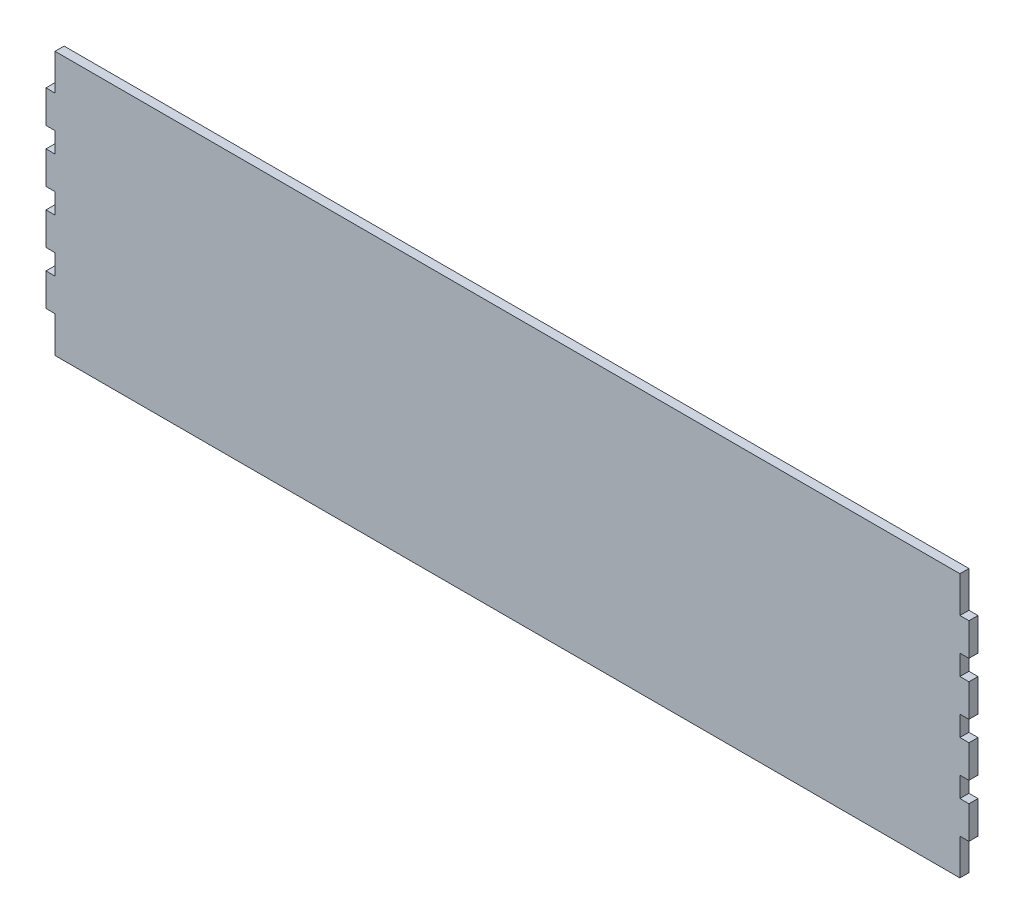
ISO-10303-21;
HEADER;
FILE_DESCRIPTION(('STEP AP214'),'2;1');
FILE_NAME('part.step','',(''),(''),'','','');
FILE_SCHEMA(('AUTOMOTIVE_DESIGN { 1 0 10303 214 1 1 1 1 }'));
ENDSEC;
DATA;
#1=APPLICATION_CONTEXT('core data for automotive mechanical design processes');
#2=APPLICATION_PROTOCOL_DEFINITION('international standard','automotive_design',2000,#1);
#3=PRODUCT_CONTEXT('',#1,'mechanical');
#4=PRODUCT('Part','Part','',(#3));
#5=PRODUCT_RELATED_PRODUCT_CATEGORY('part','',(#4));
#6=PRODUCT_DEFINITION_FORMATION('','',#4);
#7=PRODUCT_DEFINITION_CONTEXT('part definition',#1,'design');
#8=PRODUCT_DEFINITION('design','',#6,#7);
#9=PRODUCT_DEFINITION_SHAPE('','',#8);
#10=(LENGTH_UNIT() NAMED_UNIT(*) SI_UNIT(.MILLI.,.METRE.));
#11=(NAMED_UNIT(*) PLANE_ANGLE_UNIT() SI_UNIT($,.RADIAN.));
#12=(NAMED_UNIT(*) SI_UNIT($,.STERADIAN.) SOLID_ANGLE_UNIT());
#13=UNCERTAINTY_MEASURE_WITH_UNIT(LENGTH_MEASURE(1.E-05),#10,'distance_accuracy_value','');
#14=(GEOMETRIC_REPRESENTATION_CONTEXT(3) GLOBAL_UNCERTAINTY_ASSIGNED_CONTEXT((#13)) GLOBAL_UNIT_ASSIGNED_CONTEXT((#10,
#11,#12)) REPRESENTATION_CONTEXT('',''));
#15=CARTESIAN_POINT('',(0.,0.,0.));
#16=DIRECTION('',(0.,0.,1.));
#17=DIRECTION('',(1.,0.,0.));
#18=AXIS2_PLACEMENT_3D('',#15,#16,#17);
#19=CARTESIAN_POINT('',(-250.,72.795,-5.));
#20=DIRECTION('',(-1.,0.,0.));
#21=DIRECTION('',(0.,-1.,0.));
#22=AXIS2_PLACEMENT_3D('',#19,#20,#21);
#23=PLANE('',#22);
#24=DIRECTION('',(0.,-1.,0.));
#25=VECTOR('',#24,1.);
#26=CARTESIAN_POINT('',(-250.,72.795,-5.));
#27=LINE('',#26,#25);
#28=CARTESIAN_POINT('',(-250.,-23.5983333333333,-5.));
#29=VERTEX_POINT('',#28);
#30=CARTESIAN_POINT('',(-250.,-34.795,-5.));
#31=VERTEX_POINT('',#30);
#32=EDGE_CURVE('E772',#29,#31,#27,.T.);
#33=ORIENTED_EDGE('',*,*,#32,.T.);
#34=CARTESIAN_POINT('',(-250.,-34.795,-5.));
#35=CARTESIAN_POINT('',(-250.,-34.795,0.));
#36=B_SPLINE_CURVE_WITH_KNOTS('',1,(#34,#35),.UNSPECIFIED.,.F.,.F.,(2,2),(0.,0.108695652173913),.UNSPECIFIED.);
#37=CARTESIAN_POINT('',(-250.,-34.795,0.));
#38=VERTEX_POINT('',#37);
#39=EDGE_CURVE('E361',#31,#38,#36,.T.);
#40=ORIENTED_EDGE('',*,*,#39,.T.);
#41=DIRECTION('',(0.,-1.,0.));
#42=VECTOR('',#41,1.);
#43=CARTESIAN_POINT('',(-250.,72.795,0.));
#44=LINE('',#43,#42);
#45=CARTESIAN_POINT('',(-250.,-23.5983333333333,0.));
#46=VERTEX_POINT('',#45);
#47=EDGE_CURVE('E749',#46,#38,#44,.T.);
#48=ORIENTED_EDGE('',*,*,#47,.F.);
#49=CARTESIAN_POINT('',(-250.,-23.5983333333333,0.));
#50=CARTESIAN_POINT('',(-250.,-23.5983333333333,-5.));
#51=B_SPLINE_CURVE_WITH_KNOTS('',1,(#49,#50),.UNSPECIFIED.,.F.,.F.,(2,2),(0.5,
0.608695652173913),.UNSPECIFIED.);
#52=EDGE_CURVE('E375',#46,#29,#51,.T.);
#53=ORIENTED_EDGE('',*,*,#52,.T.);
#54=EDGE_LOOP('',(#33,#40,#48,#53));
#55=FACE_BOUND('',#54,.T.);
#56=ADVANCED_FACE('F104',(#55),#23,.T.);
#57=CARTESIAN_POINT('',(-250.,-52.795,0.));
#58=VERTEX_POINT('',#57);
#59=CARTESIAN_POINT('',(-250.,-72.795,0.));
#60=VERTEX_POINT('',#59);
#61=EDGE_CURVE('E661',#58,#60,#44,.T.);
#62=ORIENTED_EDGE('',*,*,#61,.F.);
#63=CARTESIAN_POINT('',(-250.,-52.795,0.));
#64=CARTESIAN_POINT('',(-250.,-52.795,-5.));
#65=B_SPLINE_CURVE_WITH_KNOTS('',1,(#63,#64),.UNSPECIFIED.,.F.,.F.,(2,2),(0.5,
0.608695652173913),.UNSPECIFIED.);
#66=CARTESIAN_POINT('',(-250.,-52.795,-5.));
#67=VERTEX_POINT('',#66);
#68=EDGE_CURVE('E351',#58,#67,#65,.T.);
#69=ORIENTED_EDGE('',*,*,#68,.T.);
#70=CARTESIAN_POINT('',(-250.,-72.795,-5.));
#71=VERTEX_POINT('',#70);
#72=EDGE_CURVE('E647',#67,#71,#27,.T.);
#73=ORIENTED_EDGE('',*,*,#72,.T.);
#74=DIRECTION('',(0.,0.,1.));
#75=VECTOR('',#74,1.);
#76=CARTESIAN_POINT('',(-250.,-72.795,-5.));
#77=LINE('',#76,#75);
#78=EDGE_CURVE('E113',#71,#60,#77,.T.);
#79=ORIENTED_EDGE('',*,*,#78,.T.);
#80=EDGE_LOOP('',(#62,#69,#73,#79));
#81=FACE_BOUND('',#80,.T.);
#82=ADVANCED_FACE('F756',(#81),#23,.T.);
#83=CARTESIAN_POINT('',(-250.,5.59833333333334,-5.));
#84=VERTEX_POINT('',#83);
#85=CARTESIAN_POINT('',(-250.,-5.59833333333332,-5.));
#86=VERTEX_POINT('',#85);
#87=EDGE_CURVE('E774',#84,#86,#27,.T.);
#88=ORIENTED_EDGE('',*,*,#87,.T.);
#89=CARTESIAN_POINT('',(-250.,-5.59833333333332,-5.));
#90=CARTESIAN_POINT('',(-250.,-5.59833333333332,0.));
#91=B_SPLINE_CURVE_WITH_KNOTS('',1,(#89,#90),.UNSPECIFIED.,.F.,.F.,(2,2),(0.,0.108695652173913),.UNSPECIFIED.);
#92=CARTESIAN_POINT('',(-250.,-5.59833333333332,0.));
#93=VERTEX_POINT('',#92);
#94=EDGE_CURVE('E374',#86,#93,#91,.T.);
#95=ORIENTED_EDGE('',*,*,#94,.T.);
#96=CARTESIAN_POINT('',(-250.,5.59833333333334,0.));
#97=VERTEX_POINT('',#96);
#98=EDGE_CURVE('E747',#97,#93,#44,.T.);
#99=ORIENTED_EDGE('',*,*,#98,.F.);
#100=CARTESIAN_POINT('',(-250.,5.59833333333334,0.));
#101=CARTESIAN_POINT('',(-250.,5.59833333333334,-5.));
#102=B_SPLINE_CURVE_WITH_KNOTS('',1,(#100,#101),.UNSPECIFIED.,.F.,.F.,(2,2),(0.5,
0.608695652173913),.UNSPECIFIED.);
#103=EDGE_CURVE('E408',#97,#84,#102,.T.);
#104=ORIENTED_EDGE('',*,*,#103,.T.);
#105=EDGE_LOOP('',(#88,#95,#99,#104));
#106=FACE_BOUND('',#105,.T.);
#107=ADVANCED_FACE('F791',(#106),#23,.T.);
#108=CARTESIAN_POINT('',(-250.,34.795,-5.));
#109=VERTEX_POINT('',#108);
#110=CARTESIAN_POINT('',(-250.,23.5983333333333,-5.));
#111=VERTEX_POINT('',#110);
#112=EDGE_CURVE('E652',#109,#111,#27,.T.);
#113=ORIENTED_EDGE('',*,*,#112,.T.);
#114=CARTESIAN_POINT('',(-250.,23.5983333333333,-5.));
#115=CARTESIAN_POINT('',(-250.,23.5983333333333,0.));
#116=B_SPLINE_CURVE_WITH_KNOTS('',1,(#114,#115),.UNSPECIFIED.,.F.,.F.,(2,2),(0.,
0.108695652173913),.UNSPECIFIED.);
#117=CARTESIAN_POINT('',(-250.,23.5983333333333,0.));
#118=VERTEX_POINT('',#117);
#119=EDGE_CURVE('E407',#111,#118,#116,.T.);
#120=ORIENTED_EDGE('',*,*,#119,.T.);
#121=CARTESIAN_POINT('',(-250.,34.795,0.));
#122=VERTEX_POINT('',#121);
#123=EDGE_CURVE('E666',#122,#118,#44,.T.);
#124=ORIENTED_EDGE('',*,*,#123,.F.);
#125=CARTESIAN_POINT('',(-250.,34.795,0.));
#126=CARTESIAN_POINT('',(-250.,34.795,-5.));
#127=B_SPLINE_CURVE_WITH_KNOTS('',1,(#125,#126),.UNSPECIFIED.,.F.,.F.,(2,2),(0.5,
0.608695652173913),.UNSPECIFIED.);
#128=EDGE_CURVE('E444',#122,#109,#127,.T.);
#129=ORIENTED_EDGE('',*,*,#128,.T.);
#130=EDGE_LOOP('',(#113,#120,#124,#129));
#131=FACE_BOUND('',#130,.T.);
#132=ADVANCED_FACE('F744',(#131),#23,.T.);
#133=CARTESIAN_POINT('',(-250.,72.795,-5.));
#134=VERTEX_POINT('',#133);
#135=CARTESIAN_POINT('',(-250.,52.795,-5.));
#136=VERTEX_POINT('',#135);
#137=EDGE_CURVE('E648',#134,#136,#27,.T.);
#138=ORIENTED_EDGE('',*,*,#137,.T.);
#139=CARTESIAN_POINT('',(-250.,52.795,-5.));
#140=CARTESIAN_POINT('',(-250.,52.795,0.));
#141=B_SPLINE_CURVE_WITH_KNOTS('',1,(#139,#140),.UNSPECIFIED.,.F.,.F.,(2,2),(0.,
0.108695652173913),.UNSPECIFIED.);
#142=CARTESIAN_POINT('',(-250.,52.795,0.));
#143=VERTEX_POINT('',#142);
#144=EDGE_CURVE('E443',#136,#143,#141,.T.);
#145=ORIENTED_EDGE('',*,*,#144,.T.);
#146=CARTESIAN_POINT('',(-250.,72.795,0.));
#147=VERTEX_POINT('',#146);
#148=EDGE_CURVE('E662',#147,#143,#44,.T.);
#149=ORIENTED_EDGE('',*,*,#148,.F.);
#150=DIRECTION('',(0.,0.,1.));
#151=VECTOR('',#150,1.);
#152=CARTESIAN_POINT('',(-250.,72.795,-5.));
#153=LINE('',#152,#151);
#154=EDGE_CURVE('E670',#134,#147,#153,.T.);
#155=ORIENTED_EDGE('',*,*,#154,.F.);
#156=EDGE_LOOP('',(#138,#145,#149,#155));
#157=FACE_BOUND('',#156,.T.);
#158=ADVANCED_FACE('F729',(#157),#23,.T.);
#159=CARTESIAN_POINT('',(250.,72.795,-5.));
#160=DIRECTION('',(1.,0.,0.));
#161=DIRECTION('',(0.,0.,-1.));
#162=AXIS2_PLACEMENT_3D('',#159,#160,#161);
#163=PLANE('',#162);
#164=CARTESIAN_POINT('',(250.,-34.795,-5.));
#165=CARTESIAN_POINT('',(250.,-34.795,0.));
#166=B_SPLINE_CURVE_WITH_KNOTS('',1,(#164,#165),.UNSPECIFIED.,.F.,.F.,(2,2),(0.,
0.108695652173913),.UNSPECIFIED.);
#167=CARTESIAN_POINT('',(250.,-34.795,-5.));
#168=VERTEX_POINT('',#167);
#169=CARTESIAN_POINT('',(250.,-34.795,0.));
#170=VERTEX_POINT('',#169);
#171=EDGE_CURVE('E479',#168,#170,#166,.T.);
#172=ORIENTED_EDGE('',*,*,#171,.F.);
#173=DIRECTION('',(0.,1.,0.));
#174=VECTOR('',#173,1.);
#175=CARTESIAN_POINT('',(250.,72.795,-5.));
#176=LINE('',#175,#174);
#177=CARTESIAN_POINT('',(250.,-23.5983333333333,-5.));
#178=VERTEX_POINT('',#177);
#179=EDGE_CURVE('E643',#168,#178,#176,.T.);
#180=ORIENTED_EDGE('',*,*,#179,.T.);
#181=CARTESIAN_POINT('',(250.,-23.5983333333333,0.));
#182=CARTESIAN_POINT('',(250.,-23.5983333333333,-5.));
#183=B_SPLINE_CURVE_WITH_KNOTS('',1,(#181,#182),.UNSPECIFIED.,.F.,.F.,(2,2),(0.5,
0.608695652173913),.UNSPECIFIED.);
#184=CARTESIAN_POINT('',(250.,-23.5983333333333,0.));
#185=VERTEX_POINT('',#184);
#186=EDGE_CURVE('E535',#185,#178,#183,.T.);
#187=ORIENTED_EDGE('',*,*,#186,.F.);
#188=DIRECTION('',(0.,1.,0.));
#189=VECTOR('',#188,1.);
#190=CARTESIAN_POINT('',(250.,72.795,0.));
#191=LINE('',#190,#189);
#192=EDGE_CURVE('E658',#170,#185,#191,.T.);
#193=ORIENTED_EDGE('',*,*,#192,.F.);
#194=EDGE_LOOP('',(#172,#180,#187,#193));
#195=FACE_BOUND('',#194,.T.);
#196=ADVANCED_FACE('F693',(#195),#163,.T.);
#197=CARTESIAN_POINT('',(250.,-5.59833333333332,-5.));
#198=CARTESIAN_POINT('',(250.,-5.59833333333332,0.));
#199=B_SPLINE_CURVE_WITH_KNOTS('',1,(#197,#198),.UNSPECIFIED.,.F.,.F.,(2,2),(0.,
0.108695652173913),.UNSPECIFIED.);
#200=CARTESIAN_POINT('',(250.,-5.59833333333332,-5.));
#201=VERTEX_POINT('',#200);
#202=CARTESIAN_POINT('',(250.,-5.59833333333332,0.));
#203=VERTEX_POINT('',#202);
#204=EDGE_CURVE('E490',#201,#203,#199,.T.);
#205=ORIENTED_EDGE('',*,*,#204,.F.);
#206=CARTESIAN_POINT('',(250.,5.59833333333334,-5.));
#207=VERTEX_POINT('',#206);
#208=EDGE_CURVE('E707',#201,#207,#176,.T.);
#209=ORIENTED_EDGE('',*,*,#208,.T.);
#210=CARTESIAN_POINT('',(250.,5.59833333333334,0.));
#211=CARTESIAN_POINT('',(250.,5.59833333333334,-5.));
#212=B_SPLINE_CURVE_WITH_KNOTS('',1,(#210,#211),.UNSPECIFIED.,.F.,.F.,(2,2),(0.5,
0.608695652173913),.UNSPECIFIED.);
#213=CARTESIAN_POINT('',(250.,5.59833333333334,0.));
#214=VERTEX_POINT('',#213);
#215=EDGE_CURVE('E575',#214,#207,#212,.T.);
#216=ORIENTED_EDGE('',*,*,#215,.F.);
#217=EDGE_CURVE('E684',#203,#214,#191,.T.);
#218=ORIENTED_EDGE('',*,*,#217,.F.);
#219=EDGE_LOOP('',(#205,#209,#216,#218));
#220=FACE_BOUND('',#219,.T.);
#221=ADVANCED_FACE('F706',(#220),#163,.T.);
#222=CARTESIAN_POINT('',(250.,23.5983333333333,-5.));
#223=CARTESIAN_POINT('',(250.,23.5983333333333,0.));
#224=B_SPLINE_CURVE_WITH_KNOTS('',1,(#222,#223),.UNSPECIFIED.,.F.,.F.,(2,2),(0.,
0.108695652173913),.UNSPECIFIED.);
#225=CARTESIAN_POINT('',(250.,23.5983333333333,-5.));
#226=VERTEX_POINT('',#225);
#227=CARTESIAN_POINT('',(250.,23.5983333333333,0.));
#228=VERTEX_POINT('',#227);
#229=EDGE_CURVE('E530',#226,#228,#224,.T.);
#230=ORIENTED_EDGE('',*,*,#229,.F.);
#231=CARTESIAN_POINT('',(250.,34.795,-5.));
#232=VERTEX_POINT('',#231);
#233=EDGE_CURVE('E712',#226,#232,#176,.T.);
#234=ORIENTED_EDGE('',*,*,#233,.T.);
#235=CARTESIAN_POINT('',(250.,34.795,0.));
#236=CARTESIAN_POINT('',(250.,34.795,-5.));
#237=B_SPLINE_CURVE_WITH_KNOTS('',1,(#235,#236),.UNSPECIFIED.,.F.,.F.,(2,2),(0.5,
0.608695652173913),.UNSPECIFIED.);
#238=CARTESIAN_POINT('',(250.,34.795,0.));
#239=VERTEX_POINT('',#238);
#240=EDGE_CURVE('E615',#239,#232,#237,.T.);
#241=ORIENTED_EDGE('',*,*,#240,.F.);
#242=EDGE_CURVE('E683',#228,#239,#191,.T.);
#243=ORIENTED_EDGE('',*,*,#242,.F.);
#244=EDGE_LOOP('',(#230,#234,#241,#243));
#245=FACE_BOUND('',#244,.T.);
#246=ADVANCED_FACE('F715',(#245),#163,.T.);
#247=CARTESIAN_POINT('',(250.,52.795,-5.));
#248=CARTESIAN_POINT('',(250.,52.795,0.));
#249=B_SPLINE_CURVE_WITH_KNOTS('',1,(#247,#248),.UNSPECIFIED.,.F.,.F.,(2,2),(0.,
0.108695652173913),.UNSPECIFIED.);
#250=CARTESIAN_POINT('',(250.,52.795,-5.));
#251=VERTEX_POINT('',#250);
#252=CARTESIAN_POINT('',(250.,52.795,0.));
#253=VERTEX_POINT('',#252);
#254=EDGE_CURVE('E570',#251,#253,#249,.T.);
#255=ORIENTED_EDGE('',*,*,#254,.F.);
#256=CARTESIAN_POINT('',(250.,72.795,-5.));
#257=VERTEX_POINT('',#256);
#258=EDGE_CURVE('E644',#251,#257,#176,.T.);
#259=ORIENTED_EDGE('',*,*,#258,.T.);
#260=DIRECTION('',(0.,0.,1.));
#261=VECTOR('',#260,1.);
#262=CARTESIAN_POINT('',(250.,72.795,-5.));
#263=LINE('',#262,#261);
#264=CARTESIAN_POINT('',(250.,72.795,0.));
#265=VERTEX_POINT('',#264);
#266=EDGE_CURVE('E108',#257,#265,#263,.T.);
#267=ORIENTED_EDGE('',*,*,#266,.T.);
#268=EDGE_CURVE('E610',#253,#265,#191,.T.);
#269=ORIENTED_EDGE('',*,*,#268,.F.);
#270=EDGE_LOOP('',(#255,#259,#267,#269));
#271=FACE_BOUND('',#270,.T.);
#272=ADVANCED_FACE('F677',(#271),#163,.T.);
#273=CARTESIAN_POINT('',(250.,-52.795,0.));
#274=CARTESIAN_POINT('',(250.,-52.795,-5.));
#275=B_SPLINE_CURVE_WITH_KNOTS('',1,(#273,#274),.UNSPECIFIED.,.F.,.F.,(2,2),(0.5,
0.608695652173913),.UNSPECIFIED.);
#276=CARTESIAN_POINT('',(250.,-52.795,0.));
#277=VERTEX_POINT('',#276);
#278=CARTESIAN_POINT('',(250.,-52.795,-5.));
#279=VERTEX_POINT('',#278);
#280=EDGE_CURVE('E495',#277,#279,#275,.T.);
#281=ORIENTED_EDGE('',*,*,#280,.F.);
#282=CARTESIAN_POINT('',(250.,-72.795,0.));
#283=VERTEX_POINT('',#282);
#284=EDGE_CURVE('E655',#283,#277,#191,.T.);
#285=ORIENTED_EDGE('',*,*,#284,.F.);
#286=DIRECTION('',(0.,0.,1.));
#287=VECTOR('',#286,1.);
#288=CARTESIAN_POINT('',(250.,-72.795,-5.));
#289=LINE('',#288,#287);
#290=CARTESIAN_POINT('',(250.,-72.795,-5.));
#291=VERTEX_POINT('',#290);
#292=EDGE_CURVE('E13',#291,#283,#289,.T.);
#293=ORIENTED_EDGE('',*,*,#292,.F.);
#294=EDGE_CURVE('E640',#291,#279,#176,.T.);
#295=ORIENTED_EDGE('',*,*,#294,.T.);
#296=EDGE_LOOP('',(#281,#285,#293,#295));
#297=FACE_BOUND('',#296,.T.);
#298=ADVANCED_FACE('F106',(#297),#163,.T.);
#299=CARTESIAN_POINT('',(-250.,-72.795,-5.));
#300=DIRECTION('',(0.,-1.,0.));
#301=DIRECTION('',(0.,0.,-1.));
#302=AXIS2_PLACEMENT_3D('',#299,#300,#301);
#303=PLANE('',#302);
#304=DIRECTION('',(1.,0.,0.));
#305=VECTOR('',#304,1.);
#306=CARTESIAN_POINT('',(-250.,-72.795,0.));
#307=LINE('',#306,#305);
#308=EDGE_CURVE('E665',#60,#283,#307,.T.);
#309=ORIENTED_EDGE('',*,*,#308,.F.);
#310=ORIENTED_EDGE('',*,*,#78,.F.);
#311=DIRECTION('',(1.,0.,0.));
#312=VECTOR('',#311,1.);
#313=CARTESIAN_POINT('',(-250.,-72.795,-5.));
#314=LINE('',#313,#312);
#315=EDGE_CURVE('E651',#71,#291,#314,.T.);
#316=ORIENTED_EDGE('',*,*,#315,.T.);
#317=ORIENTED_EDGE('',*,*,#292,.T.);
#318=EDGE_LOOP('',(#309,#310,#316,#317));
#319=FACE_BOUND('',#318,.T.);
#320=ADVANCED_FACE('F760',(#319),#303,.T.);
#321=CARTESIAN_POINT('',(-250.,72.795,-5.));
#322=DIRECTION('',(0.,1.,0.));
#323=DIRECTION('',(0.,0.,1.));
#324=AXIS2_PLACEMENT_3D('',#321,#322,#323);
#325=PLANE('',#324);
#326=DIRECTION('',(-1.,0.,0.));
#327=VECTOR('',#326,1.);
#328=CARTESIAN_POINT('',(-250.,72.795,0.));
#329=LINE('',#328,#327);
#330=EDGE_CURVE('E657',#265,#147,#329,.T.);
#331=ORIENTED_EDGE('',*,*,#330,.F.);
#332=ORIENTED_EDGE('',*,*,#266,.F.);
#333=DIRECTION('',(-1.,0.,0.));
#334=VECTOR('',#333,1.);
#335=CARTESIAN_POINT('',(-250.,72.795,-5.));
#336=LINE('',#335,#334);
#337=EDGE_CURVE('E642',#257,#134,#336,.T.);
#338=ORIENTED_EDGE('',*,*,#337,.T.);
#339=ORIENTED_EDGE('',*,*,#154,.T.);
#340=EDGE_LOOP('',(#331,#332,#338,#339));
#341=FACE_BOUND('',#340,.T.);
#342=ADVANCED_FACE('F680',(#341),#325,.T.);
#343=CARTESIAN_POINT('',(0.,0.,-5.));
#344=DIRECTION('',(0.,0.,1.));
#345=DIRECTION('',(1.,0.,0.));
#346=AXIS2_PLACEMENT_3D('',#343,#344,#345);
#347=PLANE('',#346);
#348=ORIENTED_EDGE('',*,*,#294,.F.);
#349=ORIENTED_EDGE('',*,*,#315,.F.);
#350=ORIENTED_EDGE('',*,*,#72,.F.);
#351=DIRECTION('',(1.,0.,0.));
#352=VECTOR('',#351,1.);
#353=CARTESIAN_POINT('',(-259.99999999999,-52.795,-5.));
#354=LINE('',#353,#352);
#355=CARTESIAN_POINT('',(-254.999999999995,-52.795,-5.));
#356=VERTEX_POINT('',#355);
#357=EDGE_CURVE('E121',#356,#67,#354,.T.);
#358=ORIENTED_EDGE('',*,*,#357,.F.);
#359=DIRECTION('',(0.,1.,0.));
#360=VECTOR('',#359,1.);
#361=CARTESIAN_POINT('',(-254.999999999995,-52.795,-5.));
#362=LINE('',#361,#360);
#363=CARTESIAN_POINT('',(-254.999999999995,-34.795,-5.));
#364=VERTEX_POINT('',#363);
#365=EDGE_CURVE('E347',#356,#364,#362,.T.);
#366=ORIENTED_EDGE('',*,*,#365,.T.);
#367=DIRECTION('',(1.,0.,0.));
#368=VECTOR('',#367,1.);
#369=CARTESIAN_POINT('',(-259.99999999999,-34.795,-5.));
#370=LINE('',#369,#368);
#371=EDGE_CURVE('E369',#364,#31,#370,.T.);
#372=ORIENTED_EDGE('',*,*,#371,.T.);
#373=ORIENTED_EDGE('',*,*,#32,.F.);
#374=DIRECTION('',(1.,0.,0.));
#375=VECTOR('',#374,1.);
#376=CARTESIAN_POINT('',(-259.99999999999,-23.5983333333333,-5.));
#377=LINE('',#376,#375);
#378=CARTESIAN_POINT('',(-254.999999999995,-23.5983333333333,-5.));
#379=VERTEX_POINT('',#378);
#380=EDGE_CURVE('E129',#379,#29,#377,.T.);
#381=ORIENTED_EDGE('',*,*,#380,.F.);
#382=DIRECTION('',(0.,1.,0.));
#383=VECTOR('',#382,1.);
#384=CARTESIAN_POINT('',(-254.999999999995,-23.5983333333333,-5.));
#385=LINE('',#384,#383);
#386=CARTESIAN_POINT('',(-254.999999999995,-5.59833333333332,-5.));
#387=VERTEX_POINT('',#386);
#388=EDGE_CURVE('E398',#379,#387,#385,.T.);
#389=ORIENTED_EDGE('',*,*,#388,.T.);
#390=DIRECTION('',(1.,0.,0.));
#391=VECTOR('',#390,1.);
#392=CARTESIAN_POINT('',(-259.99999999999,-5.59833333333332,-5.));
#393=LINE('',#392,#391);
#394=EDGE_CURVE('E397',#387,#86,#393,.T.);
#395=ORIENTED_EDGE('',*,*,#394,.T.);
#396=ORIENTED_EDGE('',*,*,#87,.F.);
#397=DIRECTION('',(1.,0.,0.));
#398=VECTOR('',#397,1.);
#399=CARTESIAN_POINT('',(-259.99999999999,5.59833333333334,-5.));
#400=LINE('',#399,#398);
#401=CARTESIAN_POINT('',(-254.999999999995,5.59833333333334,-5.));
#402=VERTEX_POINT('',#401);
#403=EDGE_CURVE('E435',#402,#84,#400,.T.);
#404=ORIENTED_EDGE('',*,*,#403,.F.);
#405=DIRECTION('',(0.,1.,0.));
#406=VECTOR('',#405,1.);
#407=CARTESIAN_POINT('',(-254.999999999995,5.59833333333334,-5.));
#408=LINE('',#407,#406);
#409=CARTESIAN_POINT('',(-254.999999999995,23.5983333333333,-5.));
#410=VERTEX_POINT('',#409);
#411=EDGE_CURVE('E432',#402,#410,#408,.T.);
#412=ORIENTED_EDGE('',*,*,#411,.T.);
#413=DIRECTION('',(1.,0.,0.));
#414=VECTOR('',#413,1.);
#415=CARTESIAN_POINT('',(-259.99999999999,23.5983333333333,-5.));
#416=LINE('',#415,#414);
#417=EDGE_CURVE('E431',#410,#111,#416,.T.);
#418=ORIENTED_EDGE('',*,*,#417,.T.);
#419=ORIENTED_EDGE('',*,*,#112,.F.);
#420=DIRECTION('',(1.,0.,0.));
#421=VECTOR('',#420,1.);
#422=CARTESIAN_POINT('',(-259.99999999999,34.795,-5.));
#423=LINE('',#422,#421);
#424=CARTESIAN_POINT('',(-254.999999999995,34.795,-5.));
#425=VERTEX_POINT('',#424);
#426=EDGE_CURVE('E471',#425,#109,#423,.T.);
#427=ORIENTED_EDGE('',*,*,#426,.F.);
#428=DIRECTION('',(0.,1.,0.));
#429=VECTOR('',#428,1.);
#430=CARTESIAN_POINT('',(-254.999999999995,34.795,-5.));
#431=LINE('',#430,#429);
#432=CARTESIAN_POINT('',(-254.999999999995,52.795,-5.));
#433=VERTEX_POINT('',#432);
#434=EDGE_CURVE('E468',#425,#433,#431,.T.);
#435=ORIENTED_EDGE('',*,*,#434,.T.);
#436=DIRECTION('',(1.,0.,0.));
#437=VECTOR('',#436,1.);
#438=CARTESIAN_POINT('',(-259.99999999999,52.795,-5.));
#439=LINE('',#438,#437);
#440=EDGE_CURVE('E467',#433,#136,#439,.T.);
#441=ORIENTED_EDGE('',*,*,#440,.T.);
#442=ORIENTED_EDGE('',*,*,#137,.F.);
#443=ORIENTED_EDGE('',*,*,#337,.F.);
#444=ORIENTED_EDGE('',*,*,#258,.F.);
#445=DIRECTION('',(-1.,0.,0.));
#446=VECTOR('',#445,1.);
#447=CARTESIAN_POINT('',(260.000000000002,52.795,-5.));
#448=LINE('',#447,#446);
#449=CARTESIAN_POINT('',(255.000000000001,52.795,-5.));
#450=VERTEX_POINT('',#449);
#451=EDGE_CURVE('E623',#450,#251,#448,.T.);
#452=ORIENTED_EDGE('',*,*,#451,.F.);
#453=DIRECTION('',(0.,-1.,0.));
#454=VECTOR('',#453,1.);
#455=CARTESIAN_POINT('',(255.000000000001,34.795,-5.));
#456=LINE('',#455,#454);
#457=CARTESIAN_POINT('',(255.000000000001,34.795,-5.));
#458=VERTEX_POINT('',#457);
#459=EDGE_CURVE('E604',#450,#458,#456,.T.);
#460=ORIENTED_EDGE('',*,*,#459,.T.);
#461=DIRECTION('',(-1.,0.,0.));
#462=VECTOR('',#461,1.);
#463=CARTESIAN_POINT('',(260.000000000002,34.795,-5.));
#464=LINE('',#463,#462);
#465=EDGE_CURVE('E629',#458,#232,#464,.T.);
#466=ORIENTED_EDGE('',*,*,#465,.T.);
#467=ORIENTED_EDGE('',*,*,#233,.F.);
#468=DIRECTION('',(-1.,0.,0.));
#469=VECTOR('',#468,1.);
#470=CARTESIAN_POINT('',(260.000000000002,23.5983333333333,-5.));
#471=LINE('',#470,#469);
#472=CARTESIAN_POINT('',(255.000000000001,23.5983333333333,-5.));
#473=VERTEX_POINT('',#472);
#474=EDGE_CURVE('E583',#473,#226,#471,.T.);
#475=ORIENTED_EDGE('',*,*,#474,.F.);
#476=DIRECTION('',(0.,-1.,0.));
#477=VECTOR('',#476,1.);
#478=CARTESIAN_POINT('',(255.000000000001,5.59833333333334,-5.));
#479=LINE('',#478,#477);
#480=CARTESIAN_POINT('',(255.000000000001,5.59833333333334,-5.));
#481=VERTEX_POINT('',#480);
#482=EDGE_CURVE('E564',#473,#481,#479,.T.);
#483=ORIENTED_EDGE('',*,*,#482,.T.);
#484=DIRECTION('',(-1.,0.,0.));
#485=VECTOR('',#484,1.);
#486=CARTESIAN_POINT('',(260.000000000002,5.59833333333334,-5.));
#487=LINE('',#486,#485);
#488=EDGE_CURVE('E589',#481,#207,#487,.T.);
#489=ORIENTED_EDGE('',*,*,#488,.T.);
#490=ORIENTED_EDGE('',*,*,#208,.F.);
#491=DIRECTION('',(-1.,0.,0.));
#492=VECTOR('',#491,1.);
#493=CARTESIAN_POINT('',(260.000000000002,-5.59833333333332,-5.));
#494=LINE('',#493,#492);
#495=CARTESIAN_POINT('',(255.000000000001,-5.59833333333332,-5.));
#496=VERTEX_POINT('',#495);
#497=EDGE_CURVE('E543',#496,#201,#494,.T.);
#498=ORIENTED_EDGE('',*,*,#497,.F.);
#499=DIRECTION('',(0.,-1.,0.));
#500=VECTOR('',#499,1.);
#501=CARTESIAN_POINT('',(255.000000000001,-23.5983333333333,-5.));
#502=LINE('',#501,#500);
#503=CARTESIAN_POINT('',(255.000000000001,-23.5983333333333,-5.));
#504=VERTEX_POINT('',#503);
#505=EDGE_CURVE('E524',#496,#504,#502,.T.);
#506=ORIENTED_EDGE('',*,*,#505,.T.);
#507=DIRECTION('',(-1.,0.,0.));
#508=VECTOR('',#507,1.);
#509=CARTESIAN_POINT('',(260.000000000002,-23.5983333333333,-5.));
#510=LINE('',#509,#508);
#511=EDGE_CURVE('E549',#504,#178,#510,.T.);
#512=ORIENTED_EDGE('',*,*,#511,.T.);
#513=ORIENTED_EDGE('',*,*,#179,.F.);
#514=DIRECTION('',(-1.,0.,0.));
#515=VECTOR('',#514,1.);
#516=CARTESIAN_POINT('',(260.000000000002,-34.795,-5.));
#517=LINE('',#516,#515);
#518=CARTESIAN_POINT('',(255.000000000001,-34.795,-5.));
#519=VERTEX_POINT('',#518);
#520=EDGE_CURVE('E503',#519,#168,#517,.T.);
#521=ORIENTED_EDGE('',*,*,#520,.F.);
#522=DIRECTION('',(0.,-1.,0.));
#523=VECTOR('',#522,1.);
#524=CARTESIAN_POINT('',(255.000000000001,-52.795,-5.));
#525=LINE('',#524,#523);
#526=CARTESIAN_POINT('',(255.000000000001,-52.795,-5.));
#527=VERTEX_POINT('',#526);
#528=EDGE_CURVE('E484',#519,#527,#525,.T.);
#529=ORIENTED_EDGE('',*,*,#528,.T.);
#530=DIRECTION('',(-1.,0.,0.));
#531=VECTOR('',#530,1.);
#532=CARTESIAN_POINT('',(260.000000000002,-52.795,-5.));
#533=LINE('',#532,#531);
#534=EDGE_CURVE('E509',#527,#279,#533,.T.);
#535=ORIENTED_EDGE('',*,*,#534,.T.);
#536=EDGE_LOOP('',(#348,#349,#350,#358,#366,#372,#373,#381,#389,#395,#396,#404,#412,#418,#419,
#427,#435,#441,#442,#443,#444,#452,#460,#466,#467,#475,#483,#489,#490,#498,#506,#512,#513,#521,
#529,#535));
#537=FACE_BOUND('',#536,.T.);
#538=ADVANCED_FACE('F710',(#537),#347,.F.);
#539=CARTESIAN_POINT('',(0.,0.,0.));
#540=DIRECTION('',(0.,0.,1.));
#541=DIRECTION('',(1.,0.,0.));
#542=AXIS2_PLACEMENT_3D('',#539,#540,#541);
#543=PLANE('',#542);
#544=ORIENTED_EDGE('',*,*,#284,.T.);
#545=DIRECTION('',(-1.,0.,0.));
#546=VECTOR('',#545,1.);
#547=CARTESIAN_POINT('',(260.000000000002,-52.795,0.));
#548=LINE('',#547,#546);
#549=CARTESIAN_POINT('',(255.000000000001,-52.795,0.));
#550=VERTEX_POINT('',#549);
#551=EDGE_CURVE('E512',#550,#277,#548,.T.);
#552=ORIENTED_EDGE('',*,*,#551,.F.);
#553=DIRECTION('',(0.,1.,0.));
#554=VECTOR('',#553,1.);
#555=CARTESIAN_POINT('',(255.000000000001,-34.795,0.));
#556=LINE('',#555,#554);
#557=CARTESIAN_POINT('',(255.000000000001,-34.795,0.));
#558=VERTEX_POINT('',#557);
#559=EDGE_CURVE('E483',#550,#558,#556,.T.);
#560=ORIENTED_EDGE('',*,*,#559,.T.);
#561=DIRECTION('',(-1.,0.,0.));
#562=VECTOR('',#561,1.);
#563=CARTESIAN_POINT('',(260.000000000002,-34.795,0.));
#564=LINE('',#563,#562);
#565=EDGE_CURVE('E515',#558,#170,#564,.T.);
#566=ORIENTED_EDGE('',*,*,#565,.T.);
#567=ORIENTED_EDGE('',*,*,#192,.T.);
#568=DIRECTION('',(-1.,0.,0.));
#569=VECTOR('',#568,1.);
#570=CARTESIAN_POINT('',(260.000000000002,-23.5983333333333,0.));
#571=LINE('',#570,#569);
#572=CARTESIAN_POINT('',(255.000000000001,-23.5983333333333,0.));
#573=VERTEX_POINT('',#572);
#574=EDGE_CURVE('E552',#573,#185,#571,.T.);
#575=ORIENTED_EDGE('',*,*,#574,.F.);
#576=DIRECTION('',(0.,1.,0.));
#577=VECTOR('',#576,1.);
#578=CARTESIAN_POINT('',(255.000000000001,-5.59833333333332,0.));
#579=LINE('',#578,#577);
#580=CARTESIAN_POINT('',(255.000000000001,-5.59833333333332,0.));
#581=VERTEX_POINT('',#580);
#582=EDGE_CURVE('E523',#573,#581,#579,.T.);
#583=ORIENTED_EDGE('',*,*,#582,.T.);
#584=DIRECTION('',(-1.,0.,0.));
#585=VECTOR('',#584,1.);
#586=CARTESIAN_POINT('',(260.000000000002,-5.59833333333332,0.));
#587=LINE('',#586,#585);
#588=EDGE_CURVE('E555',#581,#203,#587,.T.);
#589=ORIENTED_EDGE('',*,*,#588,.T.);
#590=ORIENTED_EDGE('',*,*,#217,.T.);
#591=DIRECTION('',(-1.,0.,0.));
#592=VECTOR('',#591,1.);
#593=CARTESIAN_POINT('',(260.000000000002,5.59833333333334,0.));
#594=LINE('',#593,#592);
#595=CARTESIAN_POINT('',(255.000000000001,5.59833333333334,0.));
#596=VERTEX_POINT('',#595);
#597=EDGE_CURVE('E592',#596,#214,#594,.T.);
#598=ORIENTED_EDGE('',*,*,#597,.F.);
#599=DIRECTION('',(0.,1.,0.));
#600=VECTOR('',#599,1.);
#601=CARTESIAN_POINT('',(255.000000000001,23.5983333333333,0.));
#602=LINE('',#601,#600);
#603=CARTESIAN_POINT('',(255.000000000001,23.5983333333333,0.));
#604=VERTEX_POINT('',#603);
#605=EDGE_CURVE('E563',#596,#604,#602,.T.);
#606=ORIENTED_EDGE('',*,*,#605,.T.);
#607=DIRECTION('',(-1.,0.,0.));
#608=VECTOR('',#607,1.);
#609=CARTESIAN_POINT('',(260.000000000002,23.5983333333333,0.));
#610=LINE('',#609,#608);
#611=EDGE_CURVE('E595',#604,#228,#610,.T.);
#612=ORIENTED_EDGE('',*,*,#611,.T.);
#613=ORIENTED_EDGE('',*,*,#242,.T.);
#614=DIRECTION('',(-1.,0.,0.));
#615=VECTOR('',#614,1.);
#616=CARTESIAN_POINT('',(260.000000000002,34.795,0.));
#617=LINE('',#616,#615);
#618=CARTESIAN_POINT('',(255.000000000001,34.795,0.));
#619=VERTEX_POINT('',#618);
#620=EDGE_CURVE('E632',#619,#239,#617,.T.);
#621=ORIENTED_EDGE('',*,*,#620,.F.);
#622=DIRECTION('',(0.,1.,0.));
#623=VECTOR('',#622,1.);
#624=CARTESIAN_POINT('',(255.000000000001,52.795,0.));
#625=LINE('',#624,#623);
#626=CARTESIAN_POINT('',(255.000000000001,52.795,0.));
#627=VERTEX_POINT('',#626);
#628=EDGE_CURVE('E603',#619,#627,#625,.T.);
#629=ORIENTED_EDGE('',*,*,#628,.T.);
#630=DIRECTION('',(-1.,0.,0.));
#631=VECTOR('',#630,1.);
#632=CARTESIAN_POINT('',(260.000000000002,52.795,0.));
#633=LINE('',#632,#631);
#634=EDGE_CURVE('E635',#627,#253,#633,.T.);
#635=ORIENTED_EDGE('',*,*,#634,.T.);
#636=ORIENTED_EDGE('',*,*,#268,.T.);
#637=ORIENTED_EDGE('',*,*,#330,.T.);
#638=ORIENTED_EDGE('',*,*,#148,.T.);
#639=DIRECTION('',(1.,0.,0.));
#640=VECTOR('',#639,1.);
#641=CARTESIAN_POINT('',(-259.99999999999,52.795,0.));
#642=LINE('',#641,#640);
#643=CARTESIAN_POINT('',(-254.999999999995,52.795,0.));
#644=VERTEX_POINT('',#643);
#645=EDGE_CURVE('E466',#644,#143,#642,.T.);
#646=ORIENTED_EDGE('',*,*,#645,.F.);
#647=DIRECTION('',(0.,-1.,0.));
#648=VECTOR('',#647,1.);
#649=CARTESIAN_POINT('',(-254.999999999995,52.795,0.));
#650=LINE('',#649,#648);
#651=CARTESIAN_POINT('',(-254.999999999995,34.795,0.));
#652=VERTEX_POINT('',#651);
#653=EDGE_CURVE('E449',#644,#652,#650,.T.);
#654=ORIENTED_EDGE('',*,*,#653,.T.);
#655=DIRECTION('',(1.,0.,0.));
#656=VECTOR('',#655,1.);
#657=CARTESIAN_POINT('',(-259.99999999999,34.795,0.));
#658=LINE('',#657,#656);
#659=EDGE_CURVE('E462',#652,#122,#658,.T.);
#660=ORIENTED_EDGE('',*,*,#659,.T.);
#661=ORIENTED_EDGE('',*,*,#123,.T.);
#662=DIRECTION('',(1.,0.,0.));
#663=VECTOR('',#662,1.);
#664=CARTESIAN_POINT('',(-259.99999999999,23.5983333333333,0.));
#665=LINE('',#664,#663);
#666=CARTESIAN_POINT('',(-254.999999999995,23.5983333333333,0.));
#667=VERTEX_POINT('',#666);
#668=EDGE_CURVE('E430',#667,#118,#665,.T.);
#669=ORIENTED_EDGE('',*,*,#668,.F.);
#670=DIRECTION('',(0.,-1.,0.));
#671=VECTOR('',#670,1.);
#672=CARTESIAN_POINT('',(-254.999999999995,23.5983333333333,0.));
#673=LINE('',#672,#671);
#674=CARTESIAN_POINT('',(-254.999999999995,5.59833333333334,0.));
#675=VERTEX_POINT('',#674);
#676=EDGE_CURVE('E413',#667,#675,#673,.T.);
#677=ORIENTED_EDGE('',*,*,#676,.T.);
#678=DIRECTION('',(1.,0.,0.));
#679=VECTOR('',#678,1.);
#680=CARTESIAN_POINT('',(-259.99999999999,5.59833333333334,0.));
#681=LINE('',#680,#679);
#682=EDGE_CURVE('E426',#675,#97,#681,.T.);
#683=ORIENTED_EDGE('',*,*,#682,.T.);
#684=ORIENTED_EDGE('',*,*,#98,.T.);
#685=DIRECTION('',(1.,0.,0.));
#686=VECTOR('',#685,1.);
#687=CARTESIAN_POINT('',(-259.99999999999,-5.59833333333332,0.));
#688=LINE('',#687,#686);
#689=CARTESIAN_POINT('',(-254.999999999995,-5.59833333333332,0.));
#690=VERTEX_POINT('',#689);
#691=EDGE_CURVE('E396',#690,#93,#688,.T.);
#692=ORIENTED_EDGE('',*,*,#691,.F.);
#693=DIRECTION('',(0.,-1.,0.));
#694=VECTOR('',#693,1.);
#695=CARTESIAN_POINT('',(-254.999999999995,-5.59833333333332,0.));
#696=LINE('',#695,#694);
#697=CARTESIAN_POINT('',(-254.999999999995,-23.5983333333333,0.));
#698=VERTEX_POINT('',#697);
#699=EDGE_CURVE('E379',#690,#698,#696,.T.);
#700=ORIENTED_EDGE('',*,*,#699,.T.);
#701=DIRECTION('',(1.,0.,0.));
#702=VECTOR('',#701,1.);
#703=CARTESIAN_POINT('',(-259.99999999999,-23.5983333333333,0.));
#704=LINE('',#703,#702);
#705=EDGE_CURVE('E392',#698,#46,#704,.T.);
#706=ORIENTED_EDGE('',*,*,#705,.T.);
#707=ORIENTED_EDGE('',*,*,#47,.T.);
#708=DIRECTION('',(1.,0.,0.));
#709=VECTOR('',#708,1.);
#710=CARTESIAN_POINT('',(-259.99999999999,-34.795,0.));
#711=LINE('',#710,#709);
#712=CARTESIAN_POINT('',(-254.999999999995,-34.795,0.));
#713=VERTEX_POINT('',#712);
#714=EDGE_CURVE('E359',#713,#38,#711,.T.);
#715=ORIENTED_EDGE('',*,*,#714,.F.);
#716=DIRECTION('',(0.,-1.,0.));
#717=VECTOR('',#716,1.);
#718=CARTESIAN_POINT('',(-254.999999999995,-34.795,0.));
#719=LINE('',#718,#717);
#720=CARTESIAN_POINT('',(-254.999999999995,-52.795,0.));
#721=VERTEX_POINT('',#720);
#722=EDGE_CURVE('E344',#713,#721,#719,.T.);
#723=ORIENTED_EDGE('',*,*,#722,.T.);
#724=DIRECTION('',(1.,0.,0.));
#725=VECTOR('',#724,1.);
#726=CARTESIAN_POINT('',(-259.99999999999,-52.795,0.));
#727=LINE('',#726,#725);
#728=EDGE_CURVE('E348',#721,#58,#727,.T.);
#729=ORIENTED_EDGE('',*,*,#728,.T.);
#730=ORIENTED_EDGE('',*,*,#61,.T.);
#731=ORIENTED_EDGE('',*,*,#308,.T.);
#732=EDGE_LOOP('',(#544,#552,#560,#566,#567,#575,#583,#589,#590,#598,#606,#612,#613,#621,#629,
#635,#636,#637,#638,#646,#654,#660,#661,#669,#677,#683,#684,#692,#700,#706,#707,#715,#723,#729,
#730,#731));
#733=FACE_BOUND('',#732,.T.);
#734=ADVANCED_FACE('F357',(#733),#543,.T.);
#735=CARTESIAN_POINT('',(260.000000000002,34.795,0.));
#736=DIRECTION('',(0.,1.,0.));
#737=DIRECTION('',(0.,0.,1.));
#738=AXIS2_PLACEMENT_3D('',#735,#736,#737);
#739=PLANE('',#738);
#740=ORIENTED_EDGE('',*,*,#465,.F.);
#741=DIRECTION('',(0.,0.,1.));
#742=VECTOR('',#741,1.);
#743=CARTESIAN_POINT('',(255.000000000001,34.795,0.));
#744=LINE('',#743,#742);
#745=EDGE_CURVE('E600',#458,#619,#744,.T.);
#746=ORIENTED_EDGE('',*,*,#745,.T.);
#747=ORIENTED_EDGE('',*,*,#620,.T.);
#748=ORIENTED_EDGE('',*,*,#240,.T.);
#749=EDGE_LOOP('',(#740,#746,#747,#748));
#750=FACE_BOUND('',#749,.T.);
#751=ADVANCED_FACE('F720',(#750),#739,.F.);
#752=CARTESIAN_POINT('',(260.000000000002,52.795,-5.));
#753=DIRECTION('',(0.,-1.,0.));
#754=DIRECTION('',(0.,0.,-1.));
#755=AXIS2_PLACEMENT_3D('',#752,#753,#754);
#756=PLANE('',#755);
#757=ORIENTED_EDGE('',*,*,#634,.F.);
#758=DIRECTION('',(0.,0.,-1.));
#759=VECTOR('',#758,1.);
#760=CARTESIAN_POINT('',(255.000000000001,52.795,-4.99999999999998));
#761=LINE('',#760,#759);
#762=EDGE_CURVE('E607',#627,#450,#761,.T.);
#763=ORIENTED_EDGE('',*,*,#762,.T.);
#764=ORIENTED_EDGE('',*,*,#451,.T.);
#765=ORIENTED_EDGE('',*,*,#254,.T.);
#766=EDGE_LOOP('',(#757,#763,#764,#765));
#767=FACE_BOUND('',#766,.T.);
#768=ADVANCED_FACE('F724',(#767),#756,.F.);
#769=CARTESIAN_POINT('',(255.000000000001,-72.795,-5.00000000000167));
#770=DIRECTION('',(-1.,0.,0.));
#771=DIRECTION('',(0.,0.,1.));
#772=AXIS2_PLACEMENT_3D('',#769,#770,#771);
#773=PLANE('',#772);
#774=ORIENTED_EDGE('',*,*,#628,.F.);
#775=ORIENTED_EDGE('',*,*,#745,.F.);
#776=ORIENTED_EDGE('',*,*,#459,.F.);
#777=ORIENTED_EDGE('',*,*,#762,.F.);
#778=EDGE_LOOP('',(#774,#775,#776,#777));
#779=FACE_BOUND('',#778,.T.);
#780=ADVANCED_FACE('F722',(#779),#773,.F.);
#781=CARTESIAN_POINT('',(260.000000000002,5.59833333333334,0.));
#782=DIRECTION('',(0.,1.,0.));
#783=DIRECTION('',(0.,0.,1.));
#784=AXIS2_PLACEMENT_3D('',#781,#782,#783);
#785=PLANE('',#784);
#786=ORIENTED_EDGE('',*,*,#488,.F.);
#787=DIRECTION('',(0.,0.,1.));
#788=VECTOR('',#787,1.);
#789=CARTESIAN_POINT('',(255.000000000001,5.59833333333334,0.));
#790=LINE('',#789,#788);
#791=EDGE_CURVE('E560',#481,#596,#790,.T.);
#792=ORIENTED_EDGE('',*,*,#791,.T.);
#793=ORIENTED_EDGE('',*,*,#597,.T.);
#794=ORIENTED_EDGE('',*,*,#215,.T.);
#795=EDGE_LOOP('',(#786,#792,#793,#794));
#796=FACE_BOUND('',#795,.T.);
#797=ADVANCED_FACE('F915',(#796),#785,.F.);
#798=CARTESIAN_POINT('',(260.000000000002,23.5983333333333,-5.));
#799=DIRECTION('',(0.,-1.,0.));
#800=DIRECTION('',(0.,0.,-1.));
#801=AXIS2_PLACEMENT_3D('',#798,#799,#800);
#802=PLANE('',#801);
#803=ORIENTED_EDGE('',*,*,#611,.F.);
#804=DIRECTION('',(0.,0.,-1.));
#805=VECTOR('',#804,1.);
#806=CARTESIAN_POINT('',(255.000000000001,23.5983333333333,-4.99999999999998));
#807=LINE('',#806,#805);
#808=EDGE_CURVE('E567',#604,#473,#807,.T.);
#809=ORIENTED_EDGE('',*,*,#808,.T.);
#810=ORIENTED_EDGE('',*,*,#474,.T.);
#811=ORIENTED_EDGE('',*,*,#229,.T.);
#812=EDGE_LOOP('',(#803,#809,#810,#811));
#813=FACE_BOUND('',#812,.T.);
#814=ADVANCED_FACE('F904',(#813),#802,.F.);
#815=CARTESIAN_POINT('',(255.000000000001,-72.795,-5.00000000000167));
#816=DIRECTION('',(-1.,0.,0.));
#817=DIRECTION('',(0.,0.,1.));
#818=AXIS2_PLACEMENT_3D('',#815,#816,#817);
#819=PLANE('',#818);
#820=ORIENTED_EDGE('',*,*,#605,.F.);
#821=ORIENTED_EDGE('',*,*,#791,.F.);
#822=ORIENTED_EDGE('',*,*,#482,.F.);
#823=ORIENTED_EDGE('',*,*,#808,.F.);
#824=EDGE_LOOP('',(#820,#821,#822,#823));
#825=FACE_BOUND('',#824,.T.);
#826=ADVANCED_FACE('F894',(#825),#819,.F.);
#827=CARTESIAN_POINT('',(260.000000000002,-23.5983333333333,0.));
#828=DIRECTION('',(0.,1.,0.));
#829=DIRECTION('',(0.,0.,1.));
#830=AXIS2_PLACEMENT_3D('',#827,#828,#829);
#831=PLANE('',#830);
#832=ORIENTED_EDGE('',*,*,#511,.F.);
#833=DIRECTION('',(0.,0.,1.));
#834=VECTOR('',#833,1.);
#835=CARTESIAN_POINT('',(255.000000000001,-23.5983333333333,0.));
#836=LINE('',#835,#834);
#837=EDGE_CURVE('E520',#504,#573,#836,.T.);
#838=ORIENTED_EDGE('',*,*,#837,.T.);
#839=ORIENTED_EDGE('',*,*,#574,.T.);
#840=ORIENTED_EDGE('',*,*,#186,.T.);
#841=EDGE_LOOP('',(#832,#838,#839,#840));
#842=FACE_BOUND('',#841,.T.);
#843=ADVANCED_FACE('F697',(#842),#831,.F.);
#844=CARTESIAN_POINT('',(260.000000000002,-5.59833333333332,-5.));
#845=DIRECTION('',(0.,-1.,0.));
#846=DIRECTION('',(0.,0.,-1.));
#847=AXIS2_PLACEMENT_3D('',#844,#845,#846);
#848=PLANE('',#847);
#849=ORIENTED_EDGE('',*,*,#588,.F.);
#850=DIRECTION('',(0.,0.,-1.));
#851=VECTOR('',#850,1.);
#852=CARTESIAN_POINT('',(255.000000000001,-5.59833333333332,-4.99999999999998));
#853=LINE('',#852,#851);
#854=EDGE_CURVE('E527',#581,#496,#853,.T.);
#855=ORIENTED_EDGE('',*,*,#854,.T.);
#856=ORIENTED_EDGE('',*,*,#497,.T.);
#857=ORIENTED_EDGE('',*,*,#204,.T.);
#858=EDGE_LOOP('',(#849,#855,#856,#857));
#859=FACE_BOUND('',#858,.T.);
#860=ADVANCED_FACE('F702',(#859),#848,.F.);
#861=CARTESIAN_POINT('',(255.000000000001,-72.795,-5.00000000000167));
#862=DIRECTION('',(-1.,0.,0.));
#863=DIRECTION('',(0.,0.,1.));
#864=AXIS2_PLACEMENT_3D('',#861,#862,#863);
#865=PLANE('',#864);
#866=ORIENTED_EDGE('',*,*,#582,.F.);
#867=ORIENTED_EDGE('',*,*,#837,.F.);
#868=ORIENTED_EDGE('',*,*,#505,.F.);
#869=ORIENTED_EDGE('',*,*,#854,.F.);
#870=EDGE_LOOP('',(#866,#867,#868,#869));
#871=FACE_BOUND('',#870,.T.);
#872=ADVANCED_FACE('F699',(#871),#865,.F.);
#873=CARTESIAN_POINT('',(260.000000000002,-52.795,0.));
#874=DIRECTION('',(0.,1.,0.));
#875=DIRECTION('',(0.,0.,1.));
#876=AXIS2_PLACEMENT_3D('',#873,#874,#875);
#877=PLANE('',#876);
#878=ORIENTED_EDGE('',*,*,#534,.F.);
#879=DIRECTION('',(0.,0.,1.));
#880=VECTOR('',#879,1.);
#881=CARTESIAN_POINT('',(255.000000000001,-52.795,0.));
#882=LINE('',#881,#880);
#883=EDGE_CURVE('E480',#527,#550,#882,.T.);
#884=ORIENTED_EDGE('',*,*,#883,.T.);
#885=ORIENTED_EDGE('',*,*,#551,.T.);
#886=ORIENTED_EDGE('',*,*,#280,.T.);
#887=EDGE_LOOP('',(#878,#884,#885,#886));
#888=FACE_BOUND('',#887,.T.);
#889=ADVANCED_FACE('F766',(#888),#877,.F.);
#890=CARTESIAN_POINT('',(260.000000000002,-34.795,-5.));
#891=DIRECTION('',(0.,-1.,0.));
#892=DIRECTION('',(0.,0.,-1.));
#893=AXIS2_PLACEMENT_3D('',#890,#891,#892);
#894=PLANE('',#893);
#895=ORIENTED_EDGE('',*,*,#565,.F.);
#896=DIRECTION('',(0.,0.,-1.));
#897=VECTOR('',#896,1.);
#898=CARTESIAN_POINT('',(255.000000000001,-34.795,-4.99999999999998));
#899=LINE('',#898,#897);
#900=EDGE_CURVE('E487',#558,#519,#899,.T.);
#901=ORIENTED_EDGE('',*,*,#900,.T.);
#902=ORIENTED_EDGE('',*,*,#520,.T.);
#903=ORIENTED_EDGE('',*,*,#171,.T.);
#904=EDGE_LOOP('',(#895,#901,#902,#903));
#905=FACE_BOUND('',#904,.T.);
#906=ADVANCED_FACE('F771',(#905),#894,.F.);
#907=CARTESIAN_POINT('',(255.000000000001,-72.795,-5.00000000000167));
#908=DIRECTION('',(-1.,0.,0.));
#909=DIRECTION('',(0.,0.,1.));
#910=AXIS2_PLACEMENT_3D('',#907,#908,#909);
#911=PLANE('',#910);
#912=ORIENTED_EDGE('',*,*,#559,.F.);
#913=ORIENTED_EDGE('',*,*,#883,.F.);
#914=ORIENTED_EDGE('',*,*,#528,.F.);
#915=ORIENTED_EDGE('',*,*,#900,.F.);
#916=EDGE_LOOP('',(#912,#913,#914,#915));
#917=FACE_BOUND('',#916,.T.);
#918=ADVANCED_FACE('F768',(#917),#911,.F.);
#919=CARTESIAN_POINT('',(-254.999999999995,-72.7949999999937,-5.00000000000282));
#920=DIRECTION('',(-1.,0.,0.));
#921=DIRECTION('',(0.,0.,1.));
#922=AXIS2_PLACEMENT_3D('',#919,#920,#921);
#923=PLANE('',#922);
#924=DIRECTION('',(0.,0.,1.));
#925=VECTOR('',#924,1.);
#926=CARTESIAN_POINT('',(-254.999999999995,52.795,-5.00000000000007));
#927=LINE('',#926,#925);
#928=EDGE_CURVE('E463',#433,#644,#927,.T.);
#929=ORIENTED_EDGE('',*,*,#928,.F.);
#930=ORIENTED_EDGE('',*,*,#434,.F.);
#931=DIRECTION('',(0.,0.,-1.));
#932=VECTOR('',#931,1.);
#933=CARTESIAN_POINT('',(-254.999999999995,34.795,0.));
#934=LINE('',#933,#932);
#935=EDGE_CURVE('E472',#652,#425,#934,.T.);
#936=ORIENTED_EDGE('',*,*,#935,.F.);
#937=ORIENTED_EDGE('',*,*,#653,.F.);
#938=EDGE_LOOP('',(#929,#930,#936,#937));
#939=FACE_BOUND('',#938,.T.);
#940=ADVANCED_FACE('F736',(#939),#923,.T.);
#941=CARTESIAN_POINT('',(-259.99999999999,34.795,0.));
#942=DIRECTION('',(0.,-1.,0.));
#943=DIRECTION('',(1.,0.,0.));
#944=AXIS2_PLACEMENT_3D('',#941,#942,#943);
#945=PLANE('',#944);
#946=ORIENTED_EDGE('',*,*,#659,.F.);
#947=ORIENTED_EDGE('',*,*,#935,.T.);
#948=ORIENTED_EDGE('',*,*,#426,.T.);
#949=ORIENTED_EDGE('',*,*,#128,.F.);
#950=EDGE_LOOP('',(#946,#947,#948,#949));
#951=FACE_BOUND('',#950,.T.);
#952=ADVANCED_FACE('F739',(#951),#945,.T.);
#953=CARTESIAN_POINT('',(-259.99999999999,52.795,-5.));
#954=DIRECTION('',(0.,1.,0.));
#955=DIRECTION('',(-1.,0.,0.));
#956=AXIS2_PLACEMENT_3D('',#953,#954,#955);
#957=PLANE('',#956);
#958=ORIENTED_EDGE('',*,*,#440,.F.);
#959=ORIENTED_EDGE('',*,*,#928,.T.);
#960=ORIENTED_EDGE('',*,*,#645,.T.);
#961=ORIENTED_EDGE('',*,*,#144,.F.);
#962=EDGE_LOOP('',(#958,#959,#960,#961));
#963=FACE_BOUND('',#962,.T.);
#964=ADVANCED_FACE('F731',(#963),#957,.T.);
#965=CARTESIAN_POINT('',(-254.999999999995,-72.7949999999937,-5.00000000000282));
#966=DIRECTION('',(-1.,0.,0.));
#967=DIRECTION('',(0.,0.,1.));
#968=AXIS2_PLACEMENT_3D('',#965,#966,#967);
#969=PLANE('',#968);
#970=DIRECTION('',(0.,0.,1.));
#971=VECTOR('',#970,1.);
#972=CARTESIAN_POINT('',(-254.999999999995,23.5983333333333,-5.00000000000007));
#973=LINE('',#972,#971);
#974=EDGE_CURVE('E427',#410,#667,#973,.T.);
#975=ORIENTED_EDGE('',*,*,#974,.F.);
#976=ORIENTED_EDGE('',*,*,#411,.F.);
#977=DIRECTION('',(0.,0.,-1.));
#978=VECTOR('',#977,1.);
#979=CARTESIAN_POINT('',(-254.999999999995,5.59833333333334,0.));
#980=LINE('',#979,#978);
#981=EDGE_CURVE('E436',#675,#402,#980,.T.);
#982=ORIENTED_EDGE('',*,*,#981,.F.);
#983=ORIENTED_EDGE('',*,*,#676,.F.);
#984=EDGE_LOOP('',(#975,#976,#982,#983));
#985=FACE_BOUND('',#984,.T.);
#986=ADVANCED_FACE('F788',(#985),#969,.T.);
#987=CARTESIAN_POINT('',(-259.99999999999,5.59833333333334,0.));
#988=DIRECTION('',(0.,-1.,0.));
#989=DIRECTION('',(1.,0.,0.));
#990=AXIS2_PLACEMENT_3D('',#987,#988,#989);
#991=PLANE('',#990);
#992=ORIENTED_EDGE('',*,*,#682,.F.);
#993=ORIENTED_EDGE('',*,*,#981,.T.);
#994=ORIENTED_EDGE('',*,*,#403,.T.);
#995=ORIENTED_EDGE('',*,*,#103,.F.);
#996=EDGE_LOOP('',(#992,#993,#994,#995));
#997=FACE_BOUND('',#996,.T.);
#998=ADVANCED_FACE('F790',(#997),#991,.T.);
#999=CARTESIAN_POINT('',(-259.99999999999,23.5983333333333,-5.));
#1000=DIRECTION('',(0.,1.,0.));
#1001=DIRECTION('',(-1.,0.,0.));
#1002=AXIS2_PLACEMENT_3D('',#999,#1000,#1001);
#1003=PLANE('',#1002);
#1004=ORIENTED_EDGE('',*,*,#417,.F.);
#1005=ORIENTED_EDGE('',*,*,#974,.T.);
#1006=ORIENTED_EDGE('',*,*,#668,.T.);
#1007=ORIENTED_EDGE('',*,*,#119,.F.);
#1008=EDGE_LOOP('',(#1004,#1005,#1006,#1007));
#1009=FACE_BOUND('',#1008,.T.);
#1010=ADVANCED_FACE('F784',(#1009),#1003,.T.);
#1011=CARTESIAN_POINT('',(-254.999999999995,-72.7949999999937,-5.00000000000282));
#1012=DIRECTION('',(-1.,0.,0.));
#1013=DIRECTION('',(0.,0.,1.));
#1014=AXIS2_PLACEMENT_3D('',#1011,#1012,#1013);
#1015=PLANE('',#1014);
#1016=DIRECTION('',(0.,0.,1.));
#1017=VECTOR('',#1016,1.);
#1018=CARTESIAN_POINT('',(-254.999999999995,-5.59833333333332,-5.00000000000007));
#1019=LINE('',#1018,#1017);
#1020=EDGE_CURVE('E393',#387,#690,#1019,.T.);
#1021=ORIENTED_EDGE('',*,*,#1020,.F.);
#1022=ORIENTED_EDGE('',*,*,#388,.F.);
#1023=DIRECTION('',(0.,0.,-1.));
#1024=VECTOR('',#1023,1.);
#1025=CARTESIAN_POINT('',(-254.999999999995,-23.5983333333333,0.));
#1026=LINE('',#1025,#1024);
#1027=EDGE_CURVE('E401',#698,#379,#1026,.T.);
#1028=ORIENTED_EDGE('',*,*,#1027,.F.);
#1029=ORIENTED_EDGE('',*,*,#699,.F.);
#1030=EDGE_LOOP('',(#1021,#1022,#1028,#1029));
#1031=FACE_BOUND('',#1030,.T.);
#1032=ADVANCED_FACE('F798',(#1031),#1015,.T.);
#1033=CARTESIAN_POINT('',(-259.99999999999,-23.5983333333333,0.));
#1034=DIRECTION('',(0.,-1.,0.));
#1035=DIRECTION('',(1.,0.,0.));
#1036=AXIS2_PLACEMENT_3D('',#1033,#1034,#1035);
#1037=PLANE('',#1036);
#1038=ORIENTED_EDGE('',*,*,#705,.F.);
#1039=ORIENTED_EDGE('',*,*,#1027,.T.);
#1040=ORIENTED_EDGE('',*,*,#380,.T.);
#1041=ORIENTED_EDGE('',*,*,#52,.F.);
#1042=EDGE_LOOP('',(#1038,#1039,#1040,#1041));
#1043=FACE_BOUND('',#1042,.T.);
#1044=ADVANCED_FACE('F799',(#1043),#1037,.T.);
#1045=CARTESIAN_POINT('',(-259.99999999999,-5.59833333333332,-5.));
#1046=DIRECTION('',(0.,1.,0.));
#1047=DIRECTION('',(-1.,0.,0.));
#1048=AXIS2_PLACEMENT_3D('',#1045,#1046,#1047);
#1049=PLANE('',#1048);
#1050=ORIENTED_EDGE('',*,*,#394,.F.);
#1051=ORIENTED_EDGE('',*,*,#1020,.T.);
#1052=ORIENTED_EDGE('',*,*,#691,.T.);
#1053=ORIENTED_EDGE('',*,*,#94,.F.);
#1054=EDGE_LOOP('',(#1050,#1051,#1052,#1053));
#1055=FACE_BOUND('',#1054,.T.);
#1056=ADVANCED_FACE('F795',(#1055),#1049,.T.);
#1057=CARTESIAN_POINT('',(-254.999999999995,-72.7949999999937,-5.00000000000282));
#1058=DIRECTION('',(-1.,0.,0.));
#1059=DIRECTION('',(0.,0.,1.));
#1060=AXIS2_PLACEMENT_3D('',#1057,#1058,#1059);
#1061=PLANE('',#1060);
#1062=DIRECTION('',(0.,0.,1.));
#1063=VECTOR('',#1062,1.);
#1064=CARTESIAN_POINT('',(-254.999999999995,-34.795,-5.00000000000007));
#1065=LINE('',#1064,#1063);
#1066=EDGE_CURVE('E367',#364,#713,#1065,.T.);
#1067=ORIENTED_EDGE('',*,*,#1066,.F.);
#1068=ORIENTED_EDGE('',*,*,#365,.F.);
#1069=DIRECTION('',(0.,0.,-1.));
#1070=VECTOR('',#1069,1.);
#1071=CARTESIAN_POINT('',(-254.999999999995,-52.795,0.));
#1072=LINE('',#1071,#1070);
#1073=EDGE_CURVE('E340',#721,#356,#1072,.T.);
#1074=ORIENTED_EDGE('',*,*,#1073,.F.);
#1075=ORIENTED_EDGE('',*,*,#722,.F.);
#1076=EDGE_LOOP('',(#1067,#1068,#1074,#1075));
#1077=FACE_BOUND('',#1076,.T.);
#1078=ADVANCED_FACE('F342',(#1077),#1061,.T.);
#1079=CARTESIAN_POINT('',(-259.99999999999,-52.795,0.));
#1080=DIRECTION('',(0.,-1.,0.));
#1081=DIRECTION('',(1.,0.,0.));
#1082=AXIS2_PLACEMENT_3D('',#1079,#1080,#1081);
#1083=PLANE('',#1082);
#1084=ORIENTED_EDGE('',*,*,#728,.F.);
#1085=ORIENTED_EDGE('',*,*,#1073,.T.);
#1086=ORIENTED_EDGE('',*,*,#357,.T.);
#1087=ORIENTED_EDGE('',*,*,#68,.F.);
#1088=EDGE_LOOP('',(#1084,#1085,#1086,#1087));
#1089=FACE_BOUND('',#1088,.T.);
#1090=ADVANCED_FACE('F350',(#1089),#1083,.T.);
#1091=CARTESIAN_POINT('',(-259.99999999999,-34.795,-5.));
#1092=DIRECTION('',(0.,1.,0.));
#1093=DIRECTION('',(-1.,0.,0.));
#1094=AXIS2_PLACEMENT_3D('',#1091,#1092,#1093);
#1095=PLANE('',#1094);
#1096=ORIENTED_EDGE('',*,*,#371,.F.);
#1097=ORIENTED_EDGE('',*,*,#1066,.T.);
#1098=ORIENTED_EDGE('',*,*,#714,.T.);
#1099=ORIENTED_EDGE('',*,*,#39,.F.);
#1100=EDGE_LOOP('',(#1096,#1097,#1098,#1099));
#1101=FACE_BOUND('',#1100,.T.);
#1102=ADVANCED_FACE('F803',(#1101),#1095,.T.);
#1103=CLOSED_SHELL('',(#56,#82,#107,#132,#158,#196,#221,#246,#272,#298,#320,#342,#538,#734,#751,
#768,#780,#797,#814,#826,#843,#860,#872,#889,#906,#918,#940,#952,#964,#986,#998,#1010,#1032,
#1044,#1056,#1078,#1090,#1102));
#1104=MANIFOLD_SOLID_BREP('B2',#1103);
#1105=ADVANCED_BREP_SHAPE_REPRESENTATION('',(#18,#1104),#14);
#1106=SHAPE_DEFINITION_REPRESENTATION(#9,#1105);
ENDSEC;
END-ISO-10303-21;
